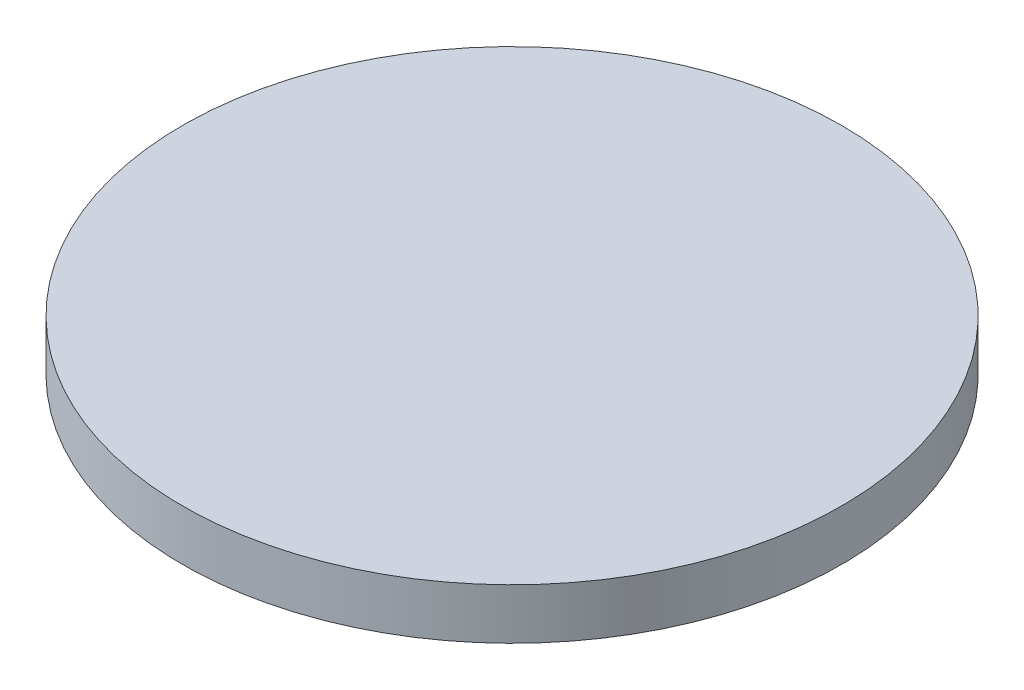
ISO-10303-21;
HEADER;
FILE_DESCRIPTION(('STEP AP214'),'2;1');
FILE_NAME('part.step','',(''),(''),'','','');
FILE_SCHEMA(('AUTOMOTIVE_DESIGN { 1 0 10303 214 1 1 1 1 }'));
ENDSEC;
DATA;
#1=APPLICATION_CONTEXT('core data for automotive mechanical design processes');
#2=APPLICATION_PROTOCOL_DEFINITION('international standard','automotive_design',2000,#1);
#3=PRODUCT_CONTEXT('',#1,'mechanical');
#4=PRODUCT('Part','Part','',(#3));
#5=PRODUCT_RELATED_PRODUCT_CATEGORY('part','',(#4));
#6=PRODUCT_DEFINITION_FORMATION('','',#4);
#7=PRODUCT_DEFINITION_CONTEXT('part definition',#1,'design');
#8=PRODUCT_DEFINITION('design','',#6,#7);
#9=PRODUCT_DEFINITION_SHAPE('','',#8);
#10=(LENGTH_UNIT() NAMED_UNIT(*) SI_UNIT(.MILLI.,.METRE.));
#11=(NAMED_UNIT(*) PLANE_ANGLE_UNIT() SI_UNIT($,.RADIAN.));
#12=(NAMED_UNIT(*) SI_UNIT($,.STERADIAN.) SOLID_ANGLE_UNIT());
#13=UNCERTAINTY_MEASURE_WITH_UNIT(LENGTH_MEASURE(1.E-05),#10,'distance_accuracy_value','');
#14=(GEOMETRIC_REPRESENTATION_CONTEXT(3) GLOBAL_UNCERTAINTY_ASSIGNED_CONTEXT((#13)) GLOBAL_UNIT_ASSIGNED_CONTEXT((#10,
#11,#12)) REPRESENTATION_CONTEXT('',''));
#15=CARTESIAN_POINT('',(0.,0.,0.));
#16=DIRECTION('',(0.,0.,1.));
#17=DIRECTION('',(1.,0.,0.));
#18=AXIS2_PLACEMENT_3D('',#15,#16,#17);
#19=CARTESIAN_POINT('',(12.5,0.,0.));
#20=DIRECTION('',(0.,-1.,0.));
#21=DIRECTION('',(0.,0.,-1.));
#22=AXIS2_PLACEMENT_3D('',#19,#20,#21);
#23=PLANE('',#22);
#24=CARTESIAN_POINT('',(0.,0.,0.));
#25=DIRECTION('',(0.,-1.,0.));
#26=DIRECTION('',(0.,0.,-1.));
#27=AXIS2_PLACEMENT_3D('',#24,#25,#26);
#28=CIRCLE('',#27,12.5);
#29=CARTESIAN_POINT('',(0.,0.,-12.5));
#30=VERTEX_POINT('',#29);
#31=EDGE_CURVE('E49',#30,#30,#28,.T.);
#32=ORIENTED_EDGE('',*,*,#31,.T.);
#33=EDGE_LOOP('',(#32));
#34=FACE_BOUND('',#33,.T.);
#35=ADVANCED_FACE('F39',(#34),#23,.T.);
#36=CARTESIAN_POINT('',(0.,15.,0.));
#37=DIRECTION('',(0.,1.,0.));
#38=DIRECTION('',(0.,0.,1.));
#39=AXIS2_PLACEMENT_3D('',#36,#37,#38);
#40=PLANE('',#39);
#41=CARTESIAN_POINT('',(0.,15.,0.));
#42=DIRECTION('',(0.,-1.,0.));
#43=DIRECTION('',(0.,0.,-1.));
#44=AXIS2_PLACEMENT_3D('',#41,#42,#43);
#45=CIRCLE('',#44,32.5);
#46=CARTESIAN_POINT('',(0.,15.,-32.5));
#47=VERTEX_POINT('',#46);
#48=EDGE_CURVE('E10',#47,#47,#45,.T.);
#49=ORIENTED_EDGE('',*,*,#48,.F.);
#50=EDGE_LOOP('',(#49));
#51=FACE_BOUND('',#50,.T.);
#52=ADVANCED_FACE('F64',(#51),#40,.T.);
#53=CARTESIAN_POINT('',(0.,0.,0.));
#54=DIRECTION('',(0.,-1.,0.));
#55=DIRECTION('',(0.,0.,-1.));
#56=AXIS2_PLACEMENT_3D('',#53,#54,#55);
#57=CYLINDRICAL_SURFACE('',#56,32.5);
#58=ORIENTED_EDGE('',*,*,#48,.T.);
#59=EDGE_LOOP('',(#58));
#60=FACE_BOUND('',#59,.T.);
#61=CARTESIAN_POINT('',(0.,10.,0.));
#62=DIRECTION('',(0.,-1.,0.));
#63=DIRECTION('',(0.,0.,-1.));
#64=AXIS2_PLACEMENT_3D('',#61,#62,#63);
#65=CIRCLE('',#64,32.5);
#66=CARTESIAN_POINT('',(0.,10.,-32.5));
#67=VERTEX_POINT('',#66);
#68=EDGE_CURVE('E45',#67,#67,#65,.T.);
#69=ORIENTED_EDGE('',*,*,#68,.F.);
#70=EDGE_LOOP('',(#69));
#71=FACE_BOUND('',#70,.T.);
#72=ADVANCED_FACE('F59',(#60,#71),#57,.T.);
#73=CARTESIAN_POINT('',(0.,0.,0.));
#74=DIRECTION('',(0.,1.,0.));
#75=DIRECTION('',(0.,0.,1.));
#76=AXIS2_PLACEMENT_3D('',#73,#74,#75);
#77=CONICAL_SURFACE('',#76,12.5,1.10714871779409);
#78=ORIENTED_EDGE('',*,*,#68,.T.);
#79=EDGE_LOOP('',(#78));
#80=FACE_BOUND('',#79,.T.);
#81=ORIENTED_EDGE('',*,*,#31,.F.);
#82=EDGE_LOOP('',(#81));
#83=FACE_BOUND('',#82,.T.);
#84=ADVANCED_FACE('F57',(#80,#83),#77,.T.);
#85=CLOSED_SHELL('',(#35,#52,#72,#84));
#86=MANIFOLD_SOLID_BREP('B2',#85);
#87=ADVANCED_BREP_SHAPE_REPRESENTATION('',(#18,#86),#14);
#88=SHAPE_DEFINITION_REPRESENTATION(#9,#87);
ENDSEC;
END-ISO-10303-21;
